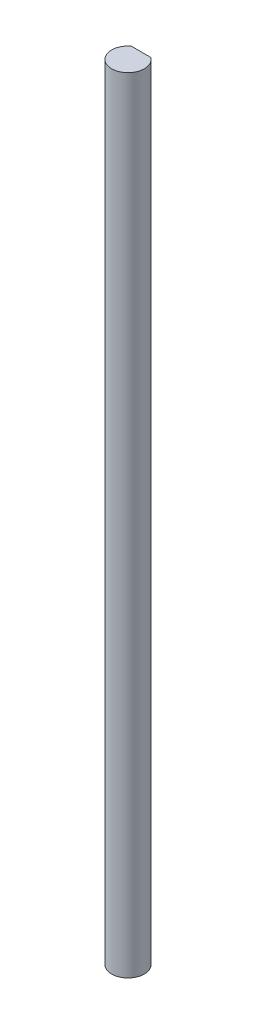
ISO-10303-21;
HEADER;
FILE_DESCRIPTION(('STEP AP214'),'2;1');
FILE_NAME('part.step','',(''),(''),'','','');
FILE_SCHEMA(('AUTOMOTIVE_DESIGN { 1 0 10303 214 1 1 1 1 }'));
ENDSEC;
DATA;
#1=APPLICATION_CONTEXT('core data for automotive mechanical design processes');
#2=APPLICATION_PROTOCOL_DEFINITION('international standard','automotive_design',2000,#1);
#3=PRODUCT_CONTEXT('',#1,'mechanical');
#4=PRODUCT('Part','Part','',(#3));
#5=PRODUCT_RELATED_PRODUCT_CATEGORY('part','',(#4));
#6=PRODUCT_DEFINITION_FORMATION('','',#4);
#7=PRODUCT_DEFINITION_CONTEXT('part definition',#1,'design');
#8=PRODUCT_DEFINITION('design','',#6,#7);
#9=PRODUCT_DEFINITION_SHAPE('','',#8);
#10=(LENGTH_UNIT() NAMED_UNIT(*) SI_UNIT(.MILLI.,.METRE.));
#11=(NAMED_UNIT(*) PLANE_ANGLE_UNIT() SI_UNIT($,.RADIAN.));
#12=(NAMED_UNIT(*) SI_UNIT($,.STERADIAN.) SOLID_ANGLE_UNIT());
#13=UNCERTAINTY_MEASURE_WITH_UNIT(LENGTH_MEASURE(1.E-05),#10,'distance_accuracy_value','');
#14=(GEOMETRIC_REPRESENTATION_CONTEXT(3) GLOBAL_UNCERTAINTY_ASSIGNED_CONTEXT((#13)) GLOBAL_UNIT_ASSIGNED_CONTEXT((#10,
#11,#12)) REPRESENTATION_CONTEXT('',''));
#15=CARTESIAN_POINT('',(0.,0.,0.));
#16=DIRECTION('',(0.,0.,1.));
#17=DIRECTION('',(1.,0.,0.));
#18=AXIS2_PLACEMENT_3D('',#15,#16,#17);
#19=CARTESIAN_POINT('',(0.,152.4,0.));
#20=DIRECTION('',(0.,-1.,0.));
#21=DIRECTION('',(0.,0.,-1.));
#22=AXIS2_PLACEMENT_3D('',#19,#20,#21);
#23=CYLINDRICAL_SURFACE('',#22,3.175);
#24=CARTESIAN_POINT('',(0.,0.,0.));
#25=DIRECTION('',(0.,1.,0.));
#26=DIRECTION('',(0.,0.,1.));
#27=AXIS2_PLACEMENT_3D('',#24,#25,#26);
#28=CIRCLE('',#27,3.175);
#29=CARTESIAN_POINT('',(-1.905,0.,-2.54));
#30=VERTEX_POINT('',#29);
#31=CARTESIAN_POINT('',(1.905,0.,-2.54));
#32=VERTEX_POINT('',#31);
#33=EDGE_CURVE('E64',#30,#32,#28,.T.);
#34=ORIENTED_EDGE('',*,*,#33,.T.);
#35=DIRECTION('',(0.,-1.,0.));
#36=VECTOR('',#35,1.);
#37=CARTESIAN_POINT('',(1.905,152.4,-2.54));
#38=LINE('',#37,#36);
#39=CARTESIAN_POINT('',(1.905,152.4,-2.54));
#40=VERTEX_POINT('',#39);
#41=EDGE_CURVE('E11',#40,#32,#38,.T.);
#42=ORIENTED_EDGE('',*,*,#41,.F.);
#43=CARTESIAN_POINT('',(0.,152.4,0.));
#44=DIRECTION('',(0.,1.,0.));
#45=DIRECTION('',(0.,0.,1.));
#46=AXIS2_PLACEMENT_3D('',#43,#44,#45);
#47=CIRCLE('',#46,3.175);
#48=CARTESIAN_POINT('',(-1.905,152.4,-2.54));
#49=VERTEX_POINT('',#48);
#50=EDGE_CURVE('E63',#49,#40,#47,.T.);
#51=ORIENTED_EDGE('',*,*,#50,.F.);
#52=DIRECTION('',(0.,-1.,0.));
#53=VECTOR('',#52,1.);
#54=CARTESIAN_POINT('',(-1.905,152.4,-2.54));
#55=LINE('',#54,#53);
#56=EDGE_CURVE('E41',#49,#30,#55,.T.);
#57=ORIENTED_EDGE('',*,*,#56,.T.);
#58=EDGE_LOOP('',(#34,#42,#51,#57));
#59=FACE_BOUND('',#58,.T.);
#60=ADVANCED_FACE('F33',(#59),#23,.T.);
#61=CARTESIAN_POINT('',(-1.905,152.4,-2.54));
#62=DIRECTION('',(0.,0.,1.));
#63=DIRECTION('',(1.,0.,0.));
#64=AXIS2_PLACEMENT_3D('',#61,#62,#63);
#65=PLANE('',#64);
#66=DIRECTION('',(-1.,0.,0.));
#67=VECTOR('',#66,1.);
#68=CARTESIAN_POINT('',(-1.905,0.,-2.54));
#69=LINE('',#68,#67);
#70=EDGE_CURVE('E56',#32,#30,#69,.T.);
#71=ORIENTED_EDGE('',*,*,#70,.T.);
#72=ORIENTED_EDGE('',*,*,#56,.F.);
#73=DIRECTION('',(-1.,0.,0.));
#74=VECTOR('',#73,1.);
#75=CARTESIAN_POINT('',(-1.905,152.4,-2.54));
#76=LINE('',#75,#74);
#77=EDGE_CURVE('E48',#40,#49,#76,.T.);
#78=ORIENTED_EDGE('',*,*,#77,.F.);
#79=ORIENTED_EDGE('',*,*,#41,.T.);
#80=EDGE_LOOP('',(#71,#72,#78,#79));
#81=FACE_BOUND('',#80,.T.);
#82=ADVANCED_FACE('F59',(#81),#65,.F.);
#83=CARTESIAN_POINT('',(0.,152.4,0.));
#84=DIRECTION('',(0.,1.,0.));
#85=DIRECTION('',(0.,0.,1.));
#86=AXIS2_PLACEMENT_3D('',#83,#84,#85);
#87=PLANE('',#86);
#88=ORIENTED_EDGE('',*,*,#50,.T.);
#89=ORIENTED_EDGE('',*,*,#77,.T.);
#90=EDGE_LOOP('',(#88,#89));
#91=FACE_BOUND('',#90,.T.);
#92=ADVANCED_FACE('F71',(#91),#87,.T.);
#93=CARTESIAN_POINT('',(0.,0.,0.));
#94=DIRECTION('',(0.,1.,0.));
#95=DIRECTION('',(0.,0.,1.));
#96=AXIS2_PLACEMENT_3D('',#93,#94,#95);
#97=PLANE('',#96);
#98=ORIENTED_EDGE('',*,*,#33,.F.);
#99=ORIENTED_EDGE('',*,*,#70,.F.);
#100=EDGE_LOOP('',(#98,#99));
#101=FACE_BOUND('',#100,.T.);
#102=ADVANCED_FACE('F67',(#101),#97,.F.);
#103=CLOSED_SHELL('',(#60,#82,#92,#102));
#104=MANIFOLD_SOLID_BREP('B2',#103);
#105=ADVANCED_BREP_SHAPE_REPRESENTATION('',(#18,#104),#14);
#106=SHAPE_DEFINITION_REPRESENTATION(#9,#105);
ENDSEC;
END-ISO-10303-21;
